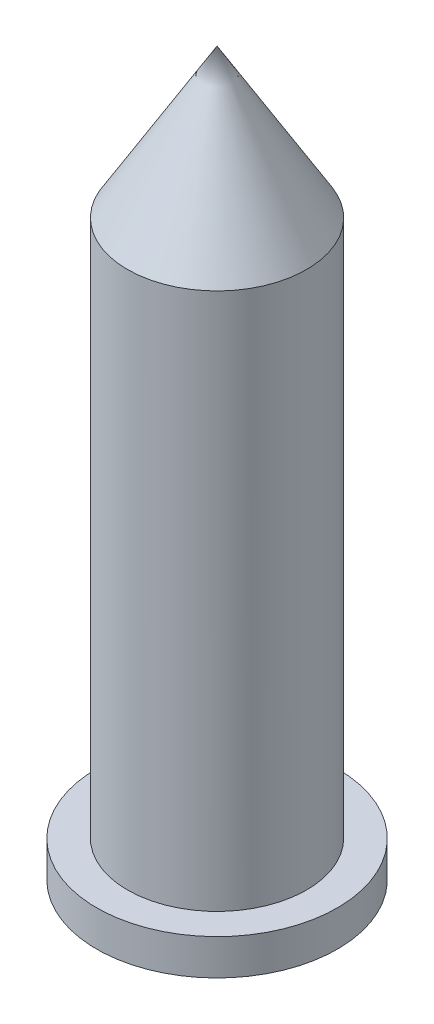
ISO-10303-21;
HEADER;
FILE_DESCRIPTION(('STEP AP214'),'2;1');
FILE_NAME('part.step','',(''),(''),'','','');
FILE_SCHEMA(('AUTOMOTIVE_DESIGN { 1 0 10303 214 1 1 1 1 }'));
ENDSEC;
DATA;
#1=APPLICATION_CONTEXT('core data for automotive mechanical design processes');
#2=APPLICATION_PROTOCOL_DEFINITION('international standard','automotive_design',2000,#1);
#3=PRODUCT_CONTEXT('',#1,'mechanical');
#4=PRODUCT('Part','Part','',(#3));
#5=PRODUCT_RELATED_PRODUCT_CATEGORY('part','',(#4));
#6=PRODUCT_DEFINITION_FORMATION('','',#4);
#7=PRODUCT_DEFINITION_CONTEXT('part definition',#1,'design');
#8=PRODUCT_DEFINITION('design','',#6,#7);
#9=PRODUCT_DEFINITION_SHAPE('','',#8);
#10=(LENGTH_UNIT() NAMED_UNIT(*) SI_UNIT(.MILLI.,.METRE.));
#11=(NAMED_UNIT(*) PLANE_ANGLE_UNIT() SI_UNIT($,.RADIAN.));
#12=(NAMED_UNIT(*) SI_UNIT($,.STERADIAN.) SOLID_ANGLE_UNIT());
#13=UNCERTAINTY_MEASURE_WITH_UNIT(LENGTH_MEASURE(1.E-05),#10,'distance_accuracy_value','');
#14=(GEOMETRIC_REPRESENTATION_CONTEXT(3) GLOBAL_UNCERTAINTY_ASSIGNED_CONTEXT((#13)) GLOBAL_UNIT_ASSIGNED_CONTEXT((#10,
#11,#12)) REPRESENTATION_CONTEXT('',''));
#15=CARTESIAN_POINT('',(0.,0.,0.));
#16=DIRECTION('',(0.,0.,1.));
#17=DIRECTION('',(1.,0.,0.));
#18=AXIS2_PLACEMENT_3D('',#15,#16,#17);
#19=CARTESIAN_POINT('',(0.,64.690625,22.9083025220977));
#20=DIRECTION('',(0.,1.,0.));
#21=DIRECTION('',(0.,0.,1.));
#22=AXIS2_PLACEMENT_3D('',#19,#20,#21);
#23=CYLINDRICAL_SURFACE('',#22,5.);
#24=CARTESIAN_POINT('',(0.,34.690625,22.9083025220977));
#25=DIRECTION('',(0.,1.,0.));
#26=DIRECTION('',(0.,0.,1.));
#27=AXIS2_PLACEMENT_3D('',#24,#25,#26);
#28=CIRCLE('',#27,5.);
#29=CARTESIAN_POINT('',(0.,34.690625,27.9083025220977));
#30=VERTEX_POINT('',#29);
#31=EDGE_CURVE('E39',#30,#30,#28,.T.);
#32=ORIENTED_EDGE('',*,*,#31,.T.);
#33=EDGE_LOOP('',(#32));
#34=FACE_BOUND('',#33,.T.);
#35=CARTESIAN_POINT('',(0.,64.690625,22.9083025220977));
#36=DIRECTION('',(0.,1.,0.));
#37=DIRECTION('',(0.,0.,1.));
#38=AXIS2_PLACEMENT_3D('',#35,#36,#37);
#39=CIRCLE('',#38,5.);
#40=CARTESIAN_POINT('',(0.,64.690625,27.9083025220977));
#41=VERTEX_POINT('',#40);
#42=EDGE_CURVE('E11',#41,#41,#39,.T.);
#43=ORIENTED_EDGE('',*,*,#42,.F.);
#44=EDGE_LOOP('',(#43));
#45=FACE_BOUND('',#44,.T.);
#46=ADVANCED_FACE('F33',(#34,#45),#23,.T.);
#47=CARTESIAN_POINT('',(0.,72.9987205154339,22.9083025220977));
#48=DIRECTION('',(0.,-1.,0.));
#49=DIRECTION('',(0.,0.,-1.));
#50=AXIS2_PLACEMENT_3D('',#47,#48,#49);
#51=CONICAL_SURFACE('',#50,0.,0.541758601241896);
#52=ORIENTED_EDGE('',*,*,#42,.T.);
#53=EDGE_LOOP('',(#52));
#54=FACE_BOUND('',#53,.T.);
#55=CARTESIAN_POINT('',(0.,72.9987205154339,22.9083025220977));
#56=VERTEX_POINT('',#55);
#57=VERTEX_LOOP('',#56);
#58=FACE_BOUND('',#57,.T.);
#59=ADVANCED_FACE('F42',(#54,#58),#51,.T.);
#60=CARTESIAN_POINT('',(0.,32.690625,22.9083025220977));
#61=DIRECTION('',(0.,1.,0.));
#62=DIRECTION('',(0.,0.,1.));
#63=AXIS2_PLACEMENT_3D('',#60,#61,#62);
#64=CYLINDRICAL_SURFACE('',#63,6.72175979852887);
#65=CARTESIAN_POINT('',(0.,32.690625,22.9083025220977));
#66=DIRECTION('',(0.,-1.,0.));
#67=DIRECTION('',(0.,0.,-1.));
#68=AXIS2_PLACEMENT_3D('',#65,#66,#67);
#69=CIRCLE('',#68,6.72175979852887);
#70=CARTESIAN_POINT('',(0.,32.690625,16.1865427235689));
#71=VERTEX_POINT('',#70);
#72=EDGE_CURVE('E65',#71,#71,#69,.T.);
#73=ORIENTED_EDGE('',*,*,#72,.F.);
#74=EDGE_LOOP('',(#73));
#75=FACE_BOUND('',#74,.T.);
#76=CARTESIAN_POINT('',(0.,34.690625,22.9083025220977));
#77=DIRECTION('',(0.,-1.,0.));
#78=DIRECTION('',(0.,0.,-1.));
#79=AXIS2_PLACEMENT_3D('',#76,#77,#78);
#80=CIRCLE('',#79,6.72175979852887);
#81=CARTESIAN_POINT('',(0.,34.690625,16.1865427235689));
#82=VERTEX_POINT('',#81);
#83=EDGE_CURVE('E66',#82,#82,#80,.T.);
#84=ORIENTED_EDGE('',*,*,#83,.T.);
#85=EDGE_LOOP('',(#84));
#86=FACE_BOUND('',#85,.T.);
#87=ADVANCED_FACE('F44',(#75,#86),#64,.T.);
#88=CARTESIAN_POINT('',(0.,32.690625,22.9083025220977));
#89=DIRECTION('',(0.,-1.,0.));
#90=DIRECTION('',(0.,0.,-1.));
#91=AXIS2_PLACEMENT_3D('',#88,#89,#90);
#92=PLANE('',#91);
#93=ORIENTED_EDGE('',*,*,#72,.T.);
#94=EDGE_LOOP('',(#93));
#95=FACE_BOUND('',#94,.T.);
#96=ADVANCED_FACE('F50',(#95),#92,.T.);
#97=CARTESIAN_POINT('',(0.,34.690625,22.9083025220977));
#98=DIRECTION('',(0.,-1.,0.));
#99=DIRECTION('',(0.,0.,-1.));
#100=AXIS2_PLACEMENT_3D('',#97,#98,#99);
#101=PLANE('',#100);
#102=ORIENTED_EDGE('',*,*,#31,.F.);
#103=EDGE_LOOP('',(#102));
#104=FACE_BOUND('',#103,.T.);
#105=ORIENTED_EDGE('',*,*,#83,.F.);
#106=EDGE_LOOP('',(#105));
#107=FACE_BOUND('',#106,.T.);
#108=ADVANCED_FACE('F55',(#104,#107),#101,.F.);
#109=CLOSED_SHELL('',(#46,#59,#87,#96,#108));
#110=MANIFOLD_SOLID_BREP('B2',#109);
#111=ADVANCED_BREP_SHAPE_REPRESENTATION('',(#18,#110),#14);
#112=SHAPE_DEFINITION_REPRESENTATION(#9,#111);
ENDSEC;
END-ISO-10303-21;
